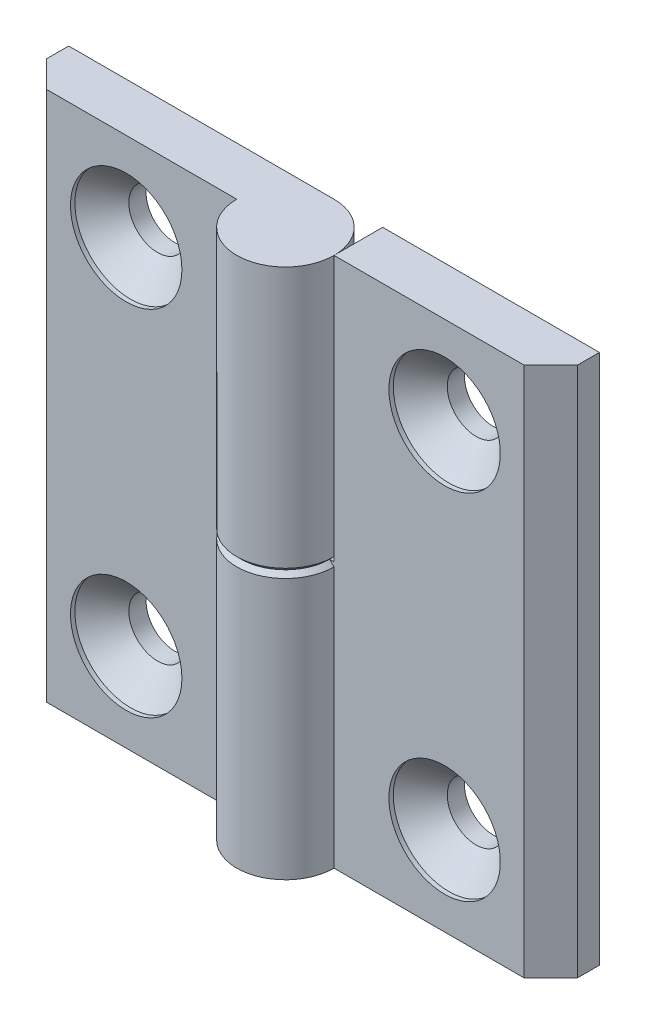
ISO-10303-21;
HEADER;
FILE_DESCRIPTION(('STEP AP214'),'2;1');
FILE_NAME('part.step','',(''),(''),'','','');
FILE_SCHEMA(('AUTOMOTIVE_DESIGN { 1 0 10303 214 1 1 1 1 }'));
ENDSEC;
DATA;
#1=APPLICATION_CONTEXT('core data for automotive mechanical design processes');
#2=APPLICATION_PROTOCOL_DEFINITION('international standard','automotive_design',2000,#1);
#3=PRODUCT_CONTEXT('',#1,'mechanical');
#4=PRODUCT('Part','Part','',(#3));
#5=PRODUCT_RELATED_PRODUCT_CATEGORY('part','',(#4));
#6=PRODUCT_DEFINITION_FORMATION('','',#4);
#7=PRODUCT_DEFINITION_CONTEXT('part definition',#1,'design');
#8=PRODUCT_DEFINITION('design','',#6,#7);
#9=PRODUCT_DEFINITION_SHAPE('','',#8);
#10=(LENGTH_UNIT() NAMED_UNIT(*) SI_UNIT(.MILLI.,.METRE.));
#11=(NAMED_UNIT(*) PLANE_ANGLE_UNIT() SI_UNIT($,.RADIAN.));
#12=(NAMED_UNIT(*) SI_UNIT($,.STERADIAN.) SOLID_ANGLE_UNIT());
#13=UNCERTAINTY_MEASURE_WITH_UNIT(LENGTH_MEASURE(1.E-05),#10,'distance_accuracy_value','');
#14=(GEOMETRIC_REPRESENTATION_CONTEXT(3) GLOBAL_UNCERTAINTY_ASSIGNED_CONTEXT((#13)) GLOBAL_UNIT_ASSIGNED_CONTEXT((#10,
#11,#12)) REPRESENTATION_CONTEXT('',''));
#15=CARTESIAN_POINT('',(0.,0.,0.));
#16=DIRECTION('',(0.,0.,1.));
#17=DIRECTION('',(1.,0.,0.));
#18=AXIS2_PLACEMENT_3D('',#15,#16,#17);
#19=CARTESIAN_POINT('',(0.,-30.,0.));
#20=DIRECTION('',(0.,1.,0.));
#21=DIRECTION('',(0.,0.,-1.));
#22=AXIS2_PLACEMENT_3D('',#19,#20,#21);
#23=CYLINDRICAL_SURFACE('',#22,5.5);
#24=DIRECTION('',(0.,1.,0.));
#25=VECTOR('',#24,1.);
#26=CARTESIAN_POINT('',(5.5,-30.,0.));
#27=LINE('',#26,#25);
#28=CARTESIAN_POINT('',(5.5,-30.,0.));
#29=VERTEX_POINT('',#28);
#30=CARTESIAN_POINT('',(5.5,-0.49999999999999,0.));
#31=VERTEX_POINT('',#30);
#32=EDGE_CURVE('E157',#29,#31,#27,.T.);
#33=ORIENTED_EDGE('',*,*,#32,.T.);
#34=CARTESIAN_POINT('',(0.,-0.49999999999999,0.));
#35=DIRECTION('',(0.,-1.,0.));
#36=DIRECTION('',(0.,0.,1.));
#37=AXIS2_PLACEMENT_3D('',#34,#35,#36);
#38=CIRCLE('',#37,5.5);
#39=CARTESIAN_POINT('',(0.,-0.49999999999999,-5.5));
#40=VERTEX_POINT('',#39);
#41=EDGE_CURVE('E175',#31,#40,#38,.T.);
#42=ORIENTED_EDGE('',*,*,#41,.T.);
#43=DIRECTION('',(0.,1.,0.));
#44=VECTOR('',#43,1.);
#45=CARTESIAN_POINT('',(0.,-30.,-5.5));
#46=LINE('',#45,#44);
#47=CARTESIAN_POINT('',(0.,-30.,-5.5));
#48=VERTEX_POINT('',#47);
#49=EDGE_CURVE('E167',#48,#40,#46,.T.);
#50=ORIENTED_EDGE('',*,*,#49,.F.);
#51=CARTESIAN_POINT('',(0.,-30.,0.));
#52=DIRECTION('',(0.,-1.,0.));
#53=DIRECTION('',(0.,0.,1.));
#54=AXIS2_PLACEMENT_3D('',#51,#52,#53);
#55=CIRCLE('',#54,5.5);
#56=EDGE_CURVE('E156',#29,#48,#55,.T.);
#57=ORIENTED_EDGE('',*,*,#56,.F.);
#58=EDGE_LOOP('',(#33,#42,#50,#57));
#59=FACE_BOUND('',#58,.T.);
#60=ADVANCED_FACE('F46',(#59),#23,.T.);
#61=CARTESIAN_POINT('',(0.,-30.,-5.5));
#62=DIRECTION('',(0.,0.,1.));
#63=DIRECTION('',(-1.,0.,0.));
#64=AXIS2_PLACEMENT_3D('',#61,#62,#63);
#65=PLANE('',#64);
#66=CARTESIAN_POINT('',(18.,-20.,-5.50000000000013));
#67=DIRECTION('',(0.,0.,1.));
#68=DIRECTION('',(-1.,0.,0.));
#69=AXIS2_PLACEMENT_3D('',#66,#67,#68);
#70=CIRCLE('',#69,3.25);
#71=CARTESIAN_POINT('',(14.75,-20.,-5.50000000000011));
#72=VERTEX_POINT('',#71);
#73=EDGE_CURVE('E197',#72,#72,#70,.T.);
#74=ORIENTED_EDGE('',*,*,#73,.T.);
#75=EDGE_LOOP('',(#74));
#76=FACE_BOUND('',#75,.T.);
#77=CARTESIAN_POINT('',(18.,20.,-5.50000000000013));
#78=DIRECTION('',(0.,0.,1.));
#79=DIRECTION('',(-1.,0.,0.));
#80=AXIS2_PLACEMENT_3D('',#77,#78,#79);
#81=CIRCLE('',#80,3.25);
#82=CARTESIAN_POINT('',(14.75,20.,-5.50000000000011));
#83=VERTEX_POINT('',#82);
#84=EDGE_CURVE('E139',#83,#83,#81,.T.);
#85=ORIENTED_EDGE('',*,*,#84,.T.);
#86=EDGE_LOOP('',(#85));
#87=FACE_BOUND('',#86,.T.);
#88=ORIENTED_EDGE('',*,*,#49,.T.);
#89=DIRECTION('',(1.,0.,0.));
#90=VECTOR('',#89,1.);
#91=CARTESIAN_POINT('',(0.,-0.49999999999999,-5.5));
#92=LINE('',#91,#90);
#93=CARTESIAN_POINT('',(5.49999999999996,-0.49999999999999,-5.50000000000004));
#94=VERTEX_POINT('',#93);
#95=EDGE_CURVE('E138',#40,#94,#92,.T.);
#96=ORIENTED_EDGE('',*,*,#95,.T.);
#97=DIRECTION('',(0.,1.,0.));
#98=VECTOR('',#97,1.);
#99=CARTESIAN_POINT('',(5.49999999999996,30.,-5.50000000000004));
#100=LINE('',#99,#98);
#101=CARTESIAN_POINT('',(5.49999999999996,30.,-5.50000000000004));
#102=VERTEX_POINT('',#101);
#103=EDGE_CURVE('E119',#94,#102,#100,.T.);
#104=ORIENTED_EDGE('',*,*,#103,.T.);
#105=DIRECTION('',(1.,0.,0.));
#106=VECTOR('',#105,1.);
#107=CARTESIAN_POINT('',(0.,30.,-5.5));
#108=LINE('',#107,#106);
#109=CARTESIAN_POINT('',(30.,30.,-5.50000000000022));
#110=VERTEX_POINT('',#109);
#111=EDGE_CURVE('E135',#102,#110,#108,.T.);
#112=ORIENTED_EDGE('',*,*,#111,.T.);
#113=DIRECTION('',(0.,1.,0.));
#114=VECTOR('',#113,1.);
#115=CARTESIAN_POINT('',(30.,-30.,-5.50000000000022));
#116=LINE('',#115,#114);
#117=CARTESIAN_POINT('',(30.,-30.,-5.50000000000022));
#118=VERTEX_POINT('',#117);
#119=EDGE_CURVE('E165',#118,#110,#116,.T.);
#120=ORIENTED_EDGE('',*,*,#119,.F.);
#121=DIRECTION('',(1.,0.,0.));
#122=VECTOR('',#121,1.);
#123=CARTESIAN_POINT('',(0.,-30.,-5.5));
#124=LINE('',#123,#122);
#125=EDGE_CURVE('E213',#48,#118,#124,.T.);
#126=ORIENTED_EDGE('',*,*,#125,.F.);
#127=EDGE_LOOP('',(#88,#96,#104,#112,#120,#126));
#128=FACE_BOUND('',#127,.T.);
#129=ADVANCED_FACE('F133',(#76,#87,#128),#65,.F.);
#130=CARTESIAN_POINT('',(30.,-30.,-5.50000000000022));
#131=DIRECTION('',(-1.,0.,0.));
#132=DIRECTION('',(0.,0.,-1.));
#133=AXIS2_PLACEMENT_3D('',#130,#131,#132);
#134=PLANE('',#133);
#135=DIRECTION('',(0.,0.,1.));
#136=VECTOR('',#135,1.);
#137=CARTESIAN_POINT('',(30.,30.,-5.50000000000022));
#138=LINE('',#137,#136);
#139=CARTESIAN_POINT('',(30.,30.,-3.00000000000022));
#140=VERTEX_POINT('',#139);
#141=EDGE_CURVE('E144',#110,#140,#138,.T.);
#142=ORIENTED_EDGE('',*,*,#141,.T.);
#143=DIRECTION('',(0.,1.,0.));
#144=VECTOR('',#143,1.);
#145=CARTESIAN_POINT('',(30.,-30.,-3.00000000000022));
#146=LINE('',#145,#144);
#147=CARTESIAN_POINT('',(30.,-30.,-3.00000000000022));
#148=VERTEX_POINT('',#147);
#149=EDGE_CURVE('E162',#148,#140,#146,.T.);
#150=ORIENTED_EDGE('',*,*,#149,.F.);
#151=DIRECTION('',(0.,0.,1.));
#152=VECTOR('',#151,1.);
#153=CARTESIAN_POINT('',(30.,-30.,-5.50000000000022));
#154=LINE('',#153,#152);
#155=EDGE_CURVE('E215',#118,#148,#154,.T.);
#156=ORIENTED_EDGE('',*,*,#155,.F.);
#157=ORIENTED_EDGE('',*,*,#119,.T.);
#158=EDGE_LOOP('',(#142,#150,#156,#157));
#159=FACE_BOUND('',#158,.T.);
#160=ADVANCED_FACE('F229',(#159),#134,.F.);
#161=CARTESIAN_POINT('',(30.,-30.,-3.00000000000022));
#162=DIRECTION('',(-0.707106781186549,0.,-0.707106781186546));
#163=DIRECTION('',(0.707106781186546,0.,-0.707106781186549));
#164=AXIS2_PLACEMENT_3D('',#161,#162,#163);
#165=PLANE('',#164);
#166=DIRECTION('',(-0.707106781186546,0.,0.707106781186549));
#167=VECTOR('',#166,1.);
#168=CARTESIAN_POINT('',(30.,30.,-3.00000000000022));
#169=LINE('',#168,#167);
#170=CARTESIAN_POINT('',(27.,30.,-2.0176617772832E-13));
#171=VERTEX_POINT('',#170);
#172=EDGE_CURVE('E146',#140,#171,#169,.T.);
#173=ORIENTED_EDGE('',*,*,#172,.T.);
#174=DIRECTION('',(0.,1.,0.));
#175=VECTOR('',#174,1.);
#176=CARTESIAN_POINT('',(27.,-30.,-2.0176617772832E-13));
#177=LINE('',#176,#175);
#178=CARTESIAN_POINT('',(27.,-30.,-2.0176617772832E-13));
#179=VERTEX_POINT('',#178);
#180=EDGE_CURVE('E159',#179,#171,#177,.T.);
#181=ORIENTED_EDGE('',*,*,#180,.F.);
#182=DIRECTION('',(-0.707106781186546,0.,0.707106781186549));
#183=VECTOR('',#182,1.);
#184=CARTESIAN_POINT('',(30.,-30.,-3.00000000000022));
#185=LINE('',#184,#183);
#186=EDGE_CURVE('E216',#148,#179,#185,.T.);
#187=ORIENTED_EDGE('',*,*,#186,.F.);
#188=ORIENTED_EDGE('',*,*,#149,.T.);
#189=EDGE_LOOP('',(#173,#181,#187,#188));
#190=FACE_BOUND('',#189,.T.);
#191=ADVANCED_FACE('F231',(#190),#165,.F.);
#192=CARTESIAN_POINT('',(27.,-30.,-2.0176617772832E-13));
#193=DIRECTION('',(0.,0.,-1.));
#194=DIRECTION('',(1.,0.,0.));
#195=AXIS2_PLACEMENT_3D('',#192,#193,#194);
#196=PLANE('',#195);
#197=CARTESIAN_POINT('',(18.,-20.,-1.34727625586711E-13));
#198=DIRECTION('',(0.,0.,1.));
#199=DIRECTION('',(-1.,0.,0.));
#200=AXIS2_PLACEMENT_3D('',#197,#198,#199);
#201=CIRCLE('',#200,6.3);
#202=CARTESIAN_POINT('',(11.7,-20.,0.));
#203=VERTEX_POINT('',#202);
#204=EDGE_CURVE('E185',#203,#203,#201,.T.);
#205=ORIENTED_EDGE('',*,*,#204,.F.);
#206=EDGE_LOOP('',(#205));
#207=FACE_BOUND('',#206,.T.);
#208=CARTESIAN_POINT('',(18.,20.,-1.34727625586711E-13));
#209=DIRECTION('',(0.,0.,1.));
#210=DIRECTION('',(-1.,0.,0.));
#211=AXIS2_PLACEMENT_3D('',#208,#209,#210);
#212=CIRCLE('',#211,6.3);
#213=CARTESIAN_POINT('',(11.7,20.,0.));
#214=VERTEX_POINT('',#213);
#215=EDGE_CURVE('E200',#214,#214,#212,.T.);
#216=ORIENTED_EDGE('',*,*,#215,.F.);
#217=EDGE_LOOP('',(#216));
#218=FACE_BOUND('',#217,.T.);
#219=DIRECTION('',(-1.,0.,0.));
#220=VECTOR('',#219,1.);
#221=CARTESIAN_POINT('',(27.,30.,-2.0176617772832E-13));
#222=LINE('',#221,#220);
#223=CARTESIAN_POINT('',(5.5,30.,0.));
#224=VERTEX_POINT('',#223);
#225=EDGE_CURVE('E154',#171,#224,#222,.T.);
#226=ORIENTED_EDGE('',*,*,#225,.T.);
#227=DIRECTION('',(0.,-1.,0.));
#228=VECTOR('',#227,1.);
#229=CARTESIAN_POINT('',(5.5,-30.,0.));
#230=LINE('',#229,#228);
#231=CARTESIAN_POINT('',(5.5,0.,0.));
#232=VERTEX_POINT('',#231);
#233=EDGE_CURVE('E123',#224,#232,#230,.T.);
#234=ORIENTED_EDGE('',*,*,#233,.T.);
#235=DIRECTION('',(1.,0.,0.));
#236=VECTOR('',#235,1.);
#237=CARTESIAN_POINT('',(-5.5,0.,0.));
#238=LINE('',#237,#236);
#239=CARTESIAN_POINT('',(5.00000000000001,0.,0.));
#240=VERTEX_POINT('',#239);
#241=EDGE_CURVE('E170',#240,#232,#238,.T.);
#242=ORIENTED_EDGE('',*,*,#241,.F.);
#243=DIRECTION('',(0.707106781186546,-0.707106781186549,0.));
#244=VECTOR('',#243,1.);
#245=CARTESIAN_POINT('',(0.,5.00000000000004,0.));
#246=LINE('',#245,#244);
#247=EDGE_CURVE('E12',#240,#31,#246,.T.);
#248=ORIENTED_EDGE('',*,*,#247,.T.);
#249=ORIENTED_EDGE('',*,*,#32,.F.);
#250=DIRECTION('',(-1.,0.,0.));
#251=VECTOR('',#250,1.);
#252=CARTESIAN_POINT('',(27.,-30.,-2.0176617772832E-13));
#253=LINE('',#252,#251);
#254=EDGE_CURVE('E150',#179,#29,#253,.T.);
#255=ORIENTED_EDGE('',*,*,#254,.F.);
#256=ORIENTED_EDGE('',*,*,#180,.T.);
#257=EDGE_LOOP('',(#226,#234,#242,#248,#249,#255,#256));
#258=FACE_BOUND('',#257,.T.);
#259=ADVANCED_FACE('F224',(#207,#218,#258),#196,.F.);
#260=CARTESIAN_POINT('',(0.,-30.,0.));
#261=DIRECTION('',(0.,-1.,0.));
#262=DIRECTION('',(0.,0.,1.));
#263=AXIS2_PLACEMENT_3D('',#260,#261,#262);
#264=PLANE('',#263);
#265=ORIENTED_EDGE('',*,*,#56,.T.);
#266=ORIENTED_EDGE('',*,*,#125,.T.);
#267=ORIENTED_EDGE('',*,*,#155,.T.);
#268=ORIENTED_EDGE('',*,*,#186,.T.);
#269=ORIENTED_EDGE('',*,*,#254,.T.);
#270=EDGE_LOOP('',(#265,#266,#267,#268,#269));
#271=FACE_BOUND('',#270,.T.);
#272=ADVANCED_FACE('F221',(#271),#264,.T.);
#273=CARTESIAN_POINT('',(0.,30.,0.));
#274=DIRECTION('',(0.,-1.,0.));
#275=DIRECTION('',(0.,0.,1.));
#276=AXIS2_PLACEMENT_3D('',#273,#274,#275);
#277=PLANE('',#276);
#278=ORIENTED_EDGE('',*,*,#111,.F.);
#279=DIRECTION('',(0.,0.,1.));
#280=VECTOR('',#279,1.);
#281=CARTESIAN_POINT('',(5.49999999999996,30.,-5.50000000000004));
#282=LINE('',#281,#280);
#283=EDGE_CURVE('E116',#102,#224,#282,.T.);
#284=ORIENTED_EDGE('',*,*,#283,.T.);
#285=ORIENTED_EDGE('',*,*,#225,.F.);
#286=ORIENTED_EDGE('',*,*,#172,.F.);
#287=ORIENTED_EDGE('',*,*,#141,.F.);
#288=EDGE_LOOP('',(#278,#284,#285,#286,#287));
#289=FACE_BOUND('',#288,.T.);
#290=ADVANCED_FACE('F142',(#289),#277,.F.);
#291=CARTESIAN_POINT('',(-5.50000000000004,0.,-5.49999999999996));
#292=DIRECTION('',(0.,-1.,0.));
#293=DIRECTION('',(0.,0.,1.));
#294=AXIS2_PLACEMENT_3D('',#291,#292,#293);
#295=PLANE('',#294);
#296=DIRECTION('',(0.,0.,1.));
#297=VECTOR('',#296,1.);
#298=CARTESIAN_POINT('',(5.49999999999996,0.,-5.50000000000004));
#299=LINE('',#298,#297);
#300=CARTESIAN_POINT('',(5.49999999999996,0.,-5.00000000000005));
#301=VERTEX_POINT('',#300);
#302=EDGE_CURVE('E128',#301,#232,#299,.T.);
#303=ORIENTED_EDGE('',*,*,#302,.F.);
#304=DIRECTION('',(-1.,0.,0.));
#305=VECTOR('',#304,1.);
#306=CARTESIAN_POINT('',(-5.50000000000004,0.,-4.99999999999997));
#307=LINE('',#306,#305);
#308=CARTESIAN_POINT('',(0.,0.,-5.00000000000001));
#309=VERTEX_POINT('',#308);
#310=EDGE_CURVE('E69',#301,#309,#307,.T.);
#311=ORIENTED_EDGE('',*,*,#310,.T.);
#312=CARTESIAN_POINT('',(0.,0.,0.));
#313=DIRECTION('',(0.,-1.,0.));
#314=DIRECTION('',(0.,0.,1.));
#315=AXIS2_PLACEMENT_3D('',#312,#313,#314);
#316=CIRCLE('',#315,5.00000000000001);
#317=EDGE_CURVE('E172',#309,#240,#316,.F.);
#318=ORIENTED_EDGE('',*,*,#317,.T.);
#319=ORIENTED_EDGE('',*,*,#241,.T.);
#320=EDGE_LOOP('',(#303,#311,#318,#319));
#321=FACE_BOUND('',#320,.T.);
#322=ADVANCED_FACE('F178',(#321),#295,.F.);
#323=CARTESIAN_POINT('',(5.49999999999996,30.,-5.50000000000004));
#324=DIRECTION('',(1.,0.,0.));
#325=DIRECTION('',(0.,0.,1.));
#326=AXIS2_PLACEMENT_3D('',#323,#324,#325);
#327=PLANE('',#326);
#328=ORIENTED_EDGE('',*,*,#283,.F.);
#329=ORIENTED_EDGE('',*,*,#103,.F.);
#330=DIRECTION('',(0.,-0.70710678118655,-0.707106781186546));
#331=VECTOR('',#330,1.);
#332=CARTESIAN_POINT('',(5.50000000000007,14.7500000000001,9.74999999999996));
#333=LINE('',#332,#331);
#334=EDGE_CURVE('E56',#94,#301,#333,.F.);
#335=ORIENTED_EDGE('',*,*,#334,.T.);
#336=ORIENTED_EDGE('',*,*,#302,.T.);
#337=ORIENTED_EDGE('',*,*,#233,.F.);
#338=EDGE_LOOP('',(#328,#329,#335,#336,#337));
#339=FACE_BOUND('',#338,.T.);
#340=ADVANCED_FACE('F118',(#339),#327,.F.);
#341=CARTESIAN_POINT('',(18.,20.,-1.34510785152214E-13));
#342=DIRECTION('',(0.,0.,1.));
#343=DIRECTION('',(-1.,0.,0.));
#344=AXIS2_PLACEMENT_3D('',#341,#342,#343);
#345=CYLINDRICAL_SURFACE('',#344,3.25);
#346=ORIENTED_EDGE('',*,*,#84,.F.);
#347=EDGE_LOOP('',(#346));
#348=FACE_BOUND('',#347,.T.);
#349=CARTESIAN_POINT('',(18.,20.,-3.55000000000013));
#350=DIRECTION('',(0.,0.,1.));
#351=DIRECTION('',(-1.,0.,0.));
#352=AXIS2_PLACEMENT_3D('',#349,#350,#351);
#353=CIRCLE('',#352,3.25);
#354=CARTESIAN_POINT('',(14.75,20.,-3.55000000000011));
#355=VERTEX_POINT('',#354);
#356=EDGE_CURVE('E206',#355,#355,#353,.T.);
#357=ORIENTED_EDGE('',*,*,#356,.T.);
#358=EDGE_LOOP('',(#357));
#359=FACE_BOUND('',#358,.T.);
#360=ADVANCED_FACE('F269',(#348,#359),#345,.F.);
#361=CARTESIAN_POINT('',(18.,20.,-0.500000000000135));
#362=DIRECTION('',(0.,0.,1.));
#363=DIRECTION('',(-1.,0.,0.));
#364=AXIS2_PLACEMENT_3D('',#361,#362,#363);
#365=CONICAL_SURFACE('',#364,6.3,0.785398163397449);
#366=ORIENTED_EDGE('',*,*,#356,.F.);
#367=EDGE_LOOP('',(#366));
#368=FACE_BOUND('',#367,.T.);
#369=CARTESIAN_POINT('',(18.,20.,-0.500000000000135));
#370=DIRECTION('',(0.,0.,1.));
#371=DIRECTION('',(-1.,0.,0.));
#372=AXIS2_PLACEMENT_3D('',#369,#370,#371);
#373=CIRCLE('',#372,6.3);
#374=CARTESIAN_POINT('',(11.7,20.,-0.500000000000088));
#375=VERTEX_POINT('',#374);
#376=EDGE_CURVE('E203',#375,#375,#373,.T.);
#377=ORIENTED_EDGE('',*,*,#376,.T.);
#378=EDGE_LOOP('',(#377));
#379=FACE_BOUND('',#378,.T.);
#380=ADVANCED_FACE('F272',(#368,#379),#365,.F.);
#381=CARTESIAN_POINT('',(18.,20.,-1.34510785152214E-13));
#382=DIRECTION('',(0.,0.,1.));
#383=DIRECTION('',(-1.,0.,0.));
#384=AXIS2_PLACEMENT_3D('',#381,#382,#383);
#385=CYLINDRICAL_SURFACE('',#384,6.3);
#386=ORIENTED_EDGE('',*,*,#376,.F.);
#387=EDGE_LOOP('',(#386));
#388=FACE_BOUND('',#387,.T.);
#389=ORIENTED_EDGE('',*,*,#215,.T.);
#390=EDGE_LOOP('',(#389));
#391=FACE_BOUND('',#390,.T.);
#392=ADVANCED_FACE('F276',(#388,#391),#385,.F.);
#393=CARTESIAN_POINT('',(18.,-20.,-1.34510785152214E-13));
#394=DIRECTION('',(0.,0.,1.));
#395=DIRECTION('',(-1.,0.,0.));
#396=AXIS2_PLACEMENT_3D('',#393,#394,#395);
#397=CYLINDRICAL_SURFACE('',#396,3.25);
#398=ORIENTED_EDGE('',*,*,#73,.F.);
#399=EDGE_LOOP('',(#398));
#400=FACE_BOUND('',#399,.T.);
#401=CARTESIAN_POINT('',(18.,-20.,-3.55000000000013));
#402=DIRECTION('',(0.,0.,1.));
#403=DIRECTION('',(-1.,0.,0.));
#404=AXIS2_PLACEMENT_3D('',#401,#402,#403);
#405=CIRCLE('',#404,3.25);
#406=CARTESIAN_POINT('',(14.75,-20.,-3.55000000000011));
#407=VERTEX_POINT('',#406);
#408=EDGE_CURVE('E192',#407,#407,#405,.T.);
#409=ORIENTED_EDGE('',*,*,#408,.T.);
#410=EDGE_LOOP('',(#409));
#411=FACE_BOUND('',#410,.T.);
#412=ADVANCED_FACE('F280',(#400,#411),#397,.F.);
#413=CARTESIAN_POINT('',(18.,-20.,-0.500000000000135));
#414=DIRECTION('',(0.,0.,1.));
#415=DIRECTION('',(-1.,0.,0.));
#416=AXIS2_PLACEMENT_3D('',#413,#414,#415);
#417=CONICAL_SURFACE('',#416,6.3,0.785398163397449);
#418=ORIENTED_EDGE('',*,*,#408,.F.);
#419=EDGE_LOOP('',(#418));
#420=FACE_BOUND('',#419,.T.);
#421=CARTESIAN_POINT('',(18.,-20.,-0.500000000000135));
#422=DIRECTION('',(0.,0.,1.));
#423=DIRECTION('',(-1.,0.,0.));
#424=AXIS2_PLACEMENT_3D('',#421,#422,#423);
#425=CIRCLE('',#424,6.3);
#426=CARTESIAN_POINT('',(11.7,-20.,-0.500000000000088));
#427=VERTEX_POINT('',#426);
#428=EDGE_CURVE('E187',#427,#427,#425,.T.);
#429=ORIENTED_EDGE('',*,*,#428,.T.);
#430=EDGE_LOOP('',(#429));
#431=FACE_BOUND('',#430,.T.);
#432=ADVANCED_FACE('F238',(#420,#431),#417,.F.);
#433=CARTESIAN_POINT('',(18.,-20.,-1.34510785152214E-13));
#434=DIRECTION('',(0.,0.,1.));
#435=DIRECTION('',(-1.,0.,0.));
#436=AXIS2_PLACEMENT_3D('',#433,#434,#435);
#437=CYLINDRICAL_SURFACE('',#436,6.3);
#438=ORIENTED_EDGE('',*,*,#428,.F.);
#439=EDGE_LOOP('',(#438));
#440=FACE_BOUND('',#439,.T.);
#441=ORIENTED_EDGE('',*,*,#204,.T.);
#442=EDGE_LOOP('',(#441));
#443=FACE_BOUND('',#442,.T.);
#444=ADVANCED_FACE('F233',(#440,#443),#437,.F.);
#445=CARTESIAN_POINT('',(0.,-0.49999999999999,0.));
#446=DIRECTION('',(0.,-1.,0.));
#447=DIRECTION('',(0.,0.,1.));
#448=AXIS2_PLACEMENT_3D('',#445,#446,#447);
#449=CONICAL_SURFACE('',#448,5.5,0.785398163397446);
#450=ORIENTED_EDGE('',*,*,#247,.F.);
#451=ORIENTED_EDGE('',*,*,#317,.F.);
#452=DIRECTION('',(0.,0.707106781186549,0.707106781186546));
#453=VECTOR('',#452,1.);
#454=CARTESIAN_POINT('',(0.,-0.49999999999999,-5.5));
#455=LINE('',#454,#453);
#456=EDGE_CURVE('E51',#40,#309,#455,.T.);
#457=ORIENTED_EDGE('',*,*,#456,.F.);
#458=ORIENTED_EDGE('',*,*,#41,.F.);
#459=EDGE_LOOP('',(#450,#451,#457,#458));
#460=FACE_BOUND('',#459,.T.);
#461=ADVANCED_FACE('F49',(#460),#449,.T.);
#462=CARTESIAN_POINT('',(0.,-0.49999999999999,-5.5));
#463=DIRECTION('',(0.,-0.707106781186546,0.70710678118655));
#464=DIRECTION('',(1.,0.,0.));
#465=AXIS2_PLACEMENT_3D('',#462,#463,#464);
#466=PLANE('',#465);
#467=ORIENTED_EDGE('',*,*,#456,.T.);
#468=ORIENTED_EDGE('',*,*,#310,.F.);
#469=ORIENTED_EDGE('',*,*,#334,.F.);
#470=ORIENTED_EDGE('',*,*,#95,.F.);
#471=EDGE_LOOP('',(#467,#468,#469,#470));
#472=FACE_BOUND('',#471,.T.);
#473=ADVANCED_FACE('F181',(#472),#466,.F.);
#474=CLOSED_SHELL('',(#60,#129,#160,#191,#259,#272,#290,#322,#340,#360,#380,#392,#412,#432,#444,
#461,#473));
#475=MANIFOLD_SOLID_BREP('B2',#474);
#476=CARTESIAN_POINT('',(0.,30.,0.));
#477=DIRECTION('',(0.,-1.,0.));
#478=DIRECTION('',(0.,0.,-1.));
#479=AXIS2_PLACEMENT_3D('',#476,#477,#478);
#480=CYLINDRICAL_SURFACE('',#479,5.5);
#481=DIRECTION('',(0.,-1.,0.));
#482=VECTOR('',#481,1.);
#483=CARTESIAN_POINT('',(-5.5,30.,0.));
#484=LINE('',#483,#482);
#485=CARTESIAN_POINT('',(-5.5,30.,0.));
#486=VERTEX_POINT('',#485);
#487=CARTESIAN_POINT('',(-5.5,0.49999999999999,0.));
#488=VERTEX_POINT('',#487);
#489=EDGE_CURVE('E512',#486,#488,#484,.T.);
#490=ORIENTED_EDGE('',*,*,#489,.T.);
#491=CARTESIAN_POINT('',(0.,0.49999999999999,0.));
#492=DIRECTION('',(0.,1.,0.));
#493=DIRECTION('',(0.,0.,1.));
#494=AXIS2_PLACEMENT_3D('',#491,#492,#493);
#495=CIRCLE('',#494,5.5);
#496=CARTESIAN_POINT('',(0.,0.49999999999999,-5.5));
#497=VERTEX_POINT('',#496);
#498=EDGE_CURVE('E530',#488,#497,#495,.T.);
#499=ORIENTED_EDGE('',*,*,#498,.T.);
#500=DIRECTION('',(0.,-1.,0.));
#501=VECTOR('',#500,1.);
#502=CARTESIAN_POINT('',(0.,30.,-5.5));
#503=LINE('',#502,#501);
#504=CARTESIAN_POINT('',(0.,30.,-5.5));
#505=VERTEX_POINT('',#504);
#506=EDGE_CURVE('E522',#505,#497,#503,.T.);
#507=ORIENTED_EDGE('',*,*,#506,.F.);
#508=CARTESIAN_POINT('',(0.,30.,0.));
#509=DIRECTION('',(0.,1.,0.));
#510=DIRECTION('',(0.,0.,1.));
#511=AXIS2_PLACEMENT_3D('',#508,#509,#510);
#512=CIRCLE('',#511,5.5);
#513=EDGE_CURVE('E511',#486,#505,#512,.T.);
#514=ORIENTED_EDGE('',*,*,#513,.F.);
#515=EDGE_LOOP('',(#490,#499,#507,#514));
#516=FACE_BOUND('',#515,.T.);
#517=ADVANCED_FACE('F401',(#516),#480,.T.);
#518=CARTESIAN_POINT('',(0.,30.,-5.5));
#519=DIRECTION('',(0.,0.,1.));
#520=DIRECTION('',(1.,0.,0.));
#521=AXIS2_PLACEMENT_3D('',#518,#519,#520);
#522=PLANE('',#521);
#523=CARTESIAN_POINT('',(-18.,20.,-5.5));
#524=DIRECTION('',(0.,0.,1.));
#525=DIRECTION('',(1.,0.,0.));
#526=AXIS2_PLACEMENT_3D('',#523,#524,#525);
#527=CIRCLE('',#526,3.25);
#528=CARTESIAN_POINT('',(-14.75,20.,-5.5));
#529=VERTEX_POINT('',#528);
#530=EDGE_CURVE('E552',#529,#529,#527,.T.);
#531=ORIENTED_EDGE('',*,*,#530,.T.);
#532=EDGE_LOOP('',(#531));
#533=FACE_BOUND('',#532,.T.);
#534=CARTESIAN_POINT('',(-18.,-20.,-5.5));
#535=DIRECTION('',(0.,0.,1.));
#536=DIRECTION('',(1.,0.,0.));
#537=AXIS2_PLACEMENT_3D('',#534,#535,#536);
#538=CIRCLE('',#537,3.25);
#539=CARTESIAN_POINT('',(-14.75,-20.,-5.5));
#540=VERTEX_POINT('',#539);
#541=EDGE_CURVE('E494',#540,#540,#538,.T.);
#542=ORIENTED_EDGE('',*,*,#541,.T.);
#543=EDGE_LOOP('',(#542));
#544=FACE_BOUND('',#543,.T.);
#545=ORIENTED_EDGE('',*,*,#506,.T.);
#546=DIRECTION('',(-1.,0.,0.));
#547=VECTOR('',#546,1.);
#548=CARTESIAN_POINT('',(0.,0.49999999999999,-5.5));
#549=LINE('',#548,#547);
#550=CARTESIAN_POINT('',(-5.5,0.49999999999999,-5.5));
#551=VERTEX_POINT('',#550);
#552=EDGE_CURVE('E493',#497,#551,#549,.T.);
#553=ORIENTED_EDGE('',*,*,#552,.T.);
#554=DIRECTION('',(0.,-1.,0.));
#555=VECTOR('',#554,1.);
#556=CARTESIAN_POINT('',(-5.5,-30.,-5.5));
#557=LINE('',#556,#555);
#558=CARTESIAN_POINT('',(-5.5,-30.,-5.5));
#559=VERTEX_POINT('',#558);
#560=EDGE_CURVE('E474',#551,#559,#557,.T.);
#561=ORIENTED_EDGE('',*,*,#560,.T.);
#562=DIRECTION('',(-1.,0.,0.));
#563=VECTOR('',#562,1.);
#564=CARTESIAN_POINT('',(0.,-30.,-5.5));
#565=LINE('',#564,#563);
#566=CARTESIAN_POINT('',(-30.,-30.,-5.5));
#567=VERTEX_POINT('',#566);
#568=EDGE_CURVE('E490',#559,#567,#565,.T.);
#569=ORIENTED_EDGE('',*,*,#568,.T.);
#570=DIRECTION('',(0.,-1.,0.));
#571=VECTOR('',#570,1.);
#572=CARTESIAN_POINT('',(-30.,30.,-5.5));
#573=LINE('',#572,#571);
#574=CARTESIAN_POINT('',(-30.,30.,-5.5));
#575=VERTEX_POINT('',#574);
#576=EDGE_CURVE('E520',#575,#567,#573,.T.);
#577=ORIENTED_EDGE('',*,*,#576,.F.);
#578=DIRECTION('',(-1.,0.,0.));
#579=VECTOR('',#578,1.);
#580=CARTESIAN_POINT('',(0.,30.,-5.5));
#581=LINE('',#580,#579);
#582=EDGE_CURVE('E568',#505,#575,#581,.T.);
#583=ORIENTED_EDGE('',*,*,#582,.F.);
#584=EDGE_LOOP('',(#545,#553,#561,#569,#577,#583));
#585=FACE_BOUND('',#584,.T.);
#586=ADVANCED_FACE('F488',(#533,#544,#585),#522,.F.);
#587=CARTESIAN_POINT('',(-30.,30.,-5.5));
#588=DIRECTION('',(1.,0.,0.));
#589=DIRECTION('',(0.,0.,-1.));
#590=AXIS2_PLACEMENT_3D('',#587,#588,#589);
#591=PLANE('',#590);
#592=DIRECTION('',(0.,0.,1.));
#593=VECTOR('',#592,1.);
#594=CARTESIAN_POINT('',(-30.,-30.,-5.5));
#595=LINE('',#594,#593);
#596=CARTESIAN_POINT('',(-30.,-30.,-3.));
#597=VERTEX_POINT('',#596);
#598=EDGE_CURVE('E499',#567,#597,#595,.T.);
#599=ORIENTED_EDGE('',*,*,#598,.T.);
#600=DIRECTION('',(0.,-1.,0.));
#601=VECTOR('',#600,1.);
#602=CARTESIAN_POINT('',(-30.,30.,-3.));
#603=LINE('',#602,#601);
#604=CARTESIAN_POINT('',(-30.,30.,-3.));
#605=VERTEX_POINT('',#604);
#606=EDGE_CURVE('E517',#605,#597,#603,.T.);
#607=ORIENTED_EDGE('',*,*,#606,.F.);
#608=DIRECTION('',(0.,0.,1.));
#609=VECTOR('',#608,1.);
#610=CARTESIAN_POINT('',(-30.,30.,-5.5));
#611=LINE('',#610,#609);
#612=EDGE_CURVE('E570',#575,#605,#611,.T.);
#613=ORIENTED_EDGE('',*,*,#612,.F.);
#614=ORIENTED_EDGE('',*,*,#576,.T.);
#615=EDGE_LOOP('',(#599,#607,#613,#614));
#616=FACE_BOUND('',#615,.T.);
#617=ADVANCED_FACE('F584',(#616),#591,.F.);
#618=CARTESIAN_POINT('',(-30.,30.,-3.));
#619=DIRECTION('',(0.707106781186543,0.,-0.707106781186552));
#620=DIRECTION('',(-0.707106781186552,0.,-0.707106781186543));
#621=AXIS2_PLACEMENT_3D('',#618,#619,#620);
#622=PLANE('',#621);
#623=DIRECTION('',(0.707106781186552,0.,0.707106781186543));
#624=VECTOR('',#623,1.);
#625=CARTESIAN_POINT('',(-30.,-30.,-3.));
#626=LINE('',#625,#624);
#627=CARTESIAN_POINT('',(-27.,-30.,0.));
#628=VERTEX_POINT('',#627);
#629=EDGE_CURVE('E501',#597,#628,#626,.T.);
#630=ORIENTED_EDGE('',*,*,#629,.T.);
#631=DIRECTION('',(0.,-1.,0.));
#632=VECTOR('',#631,1.);
#633=CARTESIAN_POINT('',(-27.,30.,0.));
#634=LINE('',#633,#632);
#635=CARTESIAN_POINT('',(-27.,30.,0.));
#636=VERTEX_POINT('',#635);
#637=EDGE_CURVE('E514',#636,#628,#634,.T.);
#638=ORIENTED_EDGE('',*,*,#637,.F.);
#639=DIRECTION('',(0.707106781186552,0.,0.707106781186543));
#640=VECTOR('',#639,1.);
#641=CARTESIAN_POINT('',(-30.,30.,-3.));
#642=LINE('',#641,#640);
#643=EDGE_CURVE('E571',#605,#636,#642,.T.);
#644=ORIENTED_EDGE('',*,*,#643,.F.);
#645=ORIENTED_EDGE('',*,*,#606,.T.);
#646=EDGE_LOOP('',(#630,#638,#644,#645));
#647=FACE_BOUND('',#646,.T.);
#648=ADVANCED_FACE('F586',(#647),#622,.F.);
#649=CARTESIAN_POINT('',(-27.,30.,0.));
#650=DIRECTION('',(0.,0.,-1.));
#651=DIRECTION('',(-1.,0.,0.));
#652=AXIS2_PLACEMENT_3D('',#649,#650,#651);
#653=PLANE('',#652);
#654=CARTESIAN_POINT('',(-18.,20.,0.));
#655=DIRECTION('',(0.,0.,1.));
#656=DIRECTION('',(1.,0.,0.));
#657=AXIS2_PLACEMENT_3D('',#654,#655,#656);
#658=CIRCLE('',#657,6.3);
#659=CARTESIAN_POINT('',(-11.7,20.,0.));
#660=VERTEX_POINT('',#659);
#661=EDGE_CURVE('E540',#660,#660,#658,.T.);
#662=ORIENTED_EDGE('',*,*,#661,.F.);
#663=EDGE_LOOP('',(#662));
#664=FACE_BOUND('',#663,.T.);
#665=CARTESIAN_POINT('',(-18.,-20.,0.));
#666=DIRECTION('',(0.,0.,1.));
#667=DIRECTION('',(1.,0.,0.));
#668=AXIS2_PLACEMENT_3D('',#665,#666,#667);
#669=CIRCLE('',#668,6.3);
#670=CARTESIAN_POINT('',(-11.7,-20.,0.));
#671=VERTEX_POINT('',#670);
#672=EDGE_CURVE('E555',#671,#671,#669,.T.);
#673=ORIENTED_EDGE('',*,*,#672,.F.);
#674=EDGE_LOOP('',(#673));
#675=FACE_BOUND('',#674,.T.);
#676=DIRECTION('',(1.,0.,0.));
#677=VECTOR('',#676,1.);
#678=CARTESIAN_POINT('',(-27.,-30.,0.));
#679=LINE('',#678,#677);
#680=CARTESIAN_POINT('',(-5.5,-30.,0.));
#681=VERTEX_POINT('',#680);
#682=EDGE_CURVE('E509',#628,#681,#679,.T.);
#683=ORIENTED_EDGE('',*,*,#682,.T.);
#684=DIRECTION('',(0.,1.,0.));
#685=VECTOR('',#684,1.);
#686=CARTESIAN_POINT('',(-5.5,30.,0.));
#687=LINE('',#686,#685);
#688=CARTESIAN_POINT('',(-5.5,0.,0.));
#689=VERTEX_POINT('',#688);
#690=EDGE_CURVE('E478',#681,#689,#687,.T.);
#691=ORIENTED_EDGE('',*,*,#690,.T.);
#692=DIRECTION('',(-1.,0.,0.));
#693=VECTOR('',#692,1.);
#694=CARTESIAN_POINT('',(5.5,0.,0.));
#695=LINE('',#694,#693);
#696=CARTESIAN_POINT('',(-5.00000000000001,0.,0.));
#697=VERTEX_POINT('',#696);
#698=EDGE_CURVE('E525',#697,#689,#695,.T.);
#699=ORIENTED_EDGE('',*,*,#698,.F.);
#700=DIRECTION('',(-0.707106781186546,0.707106781186549,0.));
#701=VECTOR('',#700,1.);
#702=CARTESIAN_POINT('',(0.,-5.00000000000004,0.));
#703=LINE('',#702,#701);
#704=EDGE_CURVE('E44',#697,#488,#703,.T.);
#705=ORIENTED_EDGE('',*,*,#704,.T.);
#706=ORIENTED_EDGE('',*,*,#489,.F.);
#707=DIRECTION('',(1.,0.,0.));
#708=VECTOR('',#707,1.);
#709=CARTESIAN_POINT('',(-27.,30.,0.));
#710=LINE('',#709,#708);
#711=EDGE_CURVE('E505',#636,#486,#710,.T.);
#712=ORIENTED_EDGE('',*,*,#711,.F.);
#713=ORIENTED_EDGE('',*,*,#637,.T.);
#714=EDGE_LOOP('',(#683,#691,#699,#705,#706,#712,#713));
#715=FACE_BOUND('',#714,.T.);
#716=ADVANCED_FACE('F579',(#664,#675,#715),#653,.F.);
#717=CARTESIAN_POINT('',(0.,30.,0.));
#718=DIRECTION('',(0.,1.,0.));
#719=DIRECTION('',(0.,0.,1.));
#720=AXIS2_PLACEMENT_3D('',#717,#718,#719);
#721=PLANE('',#720);
#722=ORIENTED_EDGE('',*,*,#513,.T.);
#723=ORIENTED_EDGE('',*,*,#582,.T.);
#724=ORIENTED_EDGE('',*,*,#612,.T.);
#725=ORIENTED_EDGE('',*,*,#643,.T.);
#726=ORIENTED_EDGE('',*,*,#711,.T.);
#727=EDGE_LOOP('',(#722,#723,#724,#725,#726));
#728=FACE_BOUND('',#727,.T.);
#729=ADVANCED_FACE('F576',(#728),#721,.T.);
#730=CARTESIAN_POINT('',(0.,-30.,0.));
#731=DIRECTION('',(0.,1.,0.));
#732=DIRECTION('',(0.,0.,1.));
#733=AXIS2_PLACEMENT_3D('',#730,#731,#732);
#734=PLANE('',#733);
#735=ORIENTED_EDGE('',*,*,#568,.F.);
#736=DIRECTION('',(0.,0.,1.));
#737=VECTOR('',#736,1.);
#738=CARTESIAN_POINT('',(-5.5,-30.,-5.5));
#739=LINE('',#738,#737);
#740=EDGE_CURVE('E471',#559,#681,#739,.T.);
#741=ORIENTED_EDGE('',*,*,#740,.T.);
#742=ORIENTED_EDGE('',*,*,#682,.F.);
#743=ORIENTED_EDGE('',*,*,#629,.F.);
#744=ORIENTED_EDGE('',*,*,#598,.F.);
#745=EDGE_LOOP('',(#735,#741,#742,#743,#744));
#746=FACE_BOUND('',#745,.T.);
#747=ADVANCED_FACE('F497',(#746),#734,.F.);
#748=CARTESIAN_POINT('',(5.5,0.,-5.5));
#749=DIRECTION('',(0.,1.,0.));
#750=DIRECTION('',(0.,0.,1.));
#751=AXIS2_PLACEMENT_3D('',#748,#749,#750);
#752=PLANE('',#751);
#753=DIRECTION('',(0.,0.,1.));
#754=VECTOR('',#753,1.);
#755=CARTESIAN_POINT('',(-5.5,0.,-5.5));
#756=LINE('',#755,#754);
#757=CARTESIAN_POINT('',(-5.5,0.,-5.00000000000001));
#758=VERTEX_POINT('',#757);
#759=EDGE_CURVE('E483',#758,#689,#756,.T.);
#760=ORIENTED_EDGE('',*,*,#759,.F.);
#761=DIRECTION('',(1.,0.,0.));
#762=VECTOR('',#761,1.);
#763=CARTESIAN_POINT('',(5.5,0.,-5.00000000000001));
#764=LINE('',#763,#762);
#765=CARTESIAN_POINT('',(0.,0.,-5.00000000000001));
#766=VERTEX_POINT('',#765);
#767=EDGE_CURVE('E424',#758,#766,#764,.T.);
#768=ORIENTED_EDGE('',*,*,#767,.T.);
#769=CARTESIAN_POINT('',(0.,0.,0.));
#770=DIRECTION('',(0.,1.,0.));
#771=DIRECTION('',(0.,0.,1.));
#772=AXIS2_PLACEMENT_3D('',#769,#770,#771);
#773=CIRCLE('',#772,5.00000000000001);
#774=EDGE_CURVE('E527',#766,#697,#773,.F.);
#775=ORIENTED_EDGE('',*,*,#774,.T.);
#776=ORIENTED_EDGE('',*,*,#698,.T.);
#777=EDGE_LOOP('',(#760,#768,#775,#776));
#778=FACE_BOUND('',#777,.T.);
#779=ADVANCED_FACE('F533',(#778),#752,.F.);
#780=CARTESIAN_POINT('',(-5.5,-30.,-5.5));
#781=DIRECTION('',(-1.,0.,0.));
#782=DIRECTION('',(0.,0.,1.));
#783=AXIS2_PLACEMENT_3D('',#780,#781,#782);
#784=PLANE('',#783);
#785=ORIENTED_EDGE('',*,*,#740,.F.);
#786=ORIENTED_EDGE('',*,*,#560,.F.);
#787=DIRECTION('',(0.,0.70710678118655,-0.707106781186546));
#788=VECTOR('',#787,1.);
#789=CARTESIAN_POINT('',(-5.5,-14.7500000000001,9.75));
#790=LINE('',#789,#788);
#791=EDGE_CURVE('E411',#551,#758,#790,.F.);
#792=ORIENTED_EDGE('',*,*,#791,.T.);
#793=ORIENTED_EDGE('',*,*,#759,.T.);
#794=ORIENTED_EDGE('',*,*,#690,.F.);
#795=EDGE_LOOP('',(#785,#786,#792,#793,#794));
#796=FACE_BOUND('',#795,.T.);
#797=ADVANCED_FACE('F473',(#796),#784,.F.);
#798=CARTESIAN_POINT('',(-18.,-20.,0.));
#799=DIRECTION('',(0.,0.,1.));
#800=DIRECTION('',(1.,0.,0.));
#801=AXIS2_PLACEMENT_3D('',#798,#799,#800);
#802=CYLINDRICAL_SURFACE('',#801,3.25);
#803=ORIENTED_EDGE('',*,*,#541,.F.);
#804=EDGE_LOOP('',(#803));
#805=FACE_BOUND('',#804,.T.);
#806=CARTESIAN_POINT('',(-18.,-20.,-3.55));
#807=DIRECTION('',(0.,0.,1.));
#808=DIRECTION('',(1.,0.,0.));
#809=AXIS2_PLACEMENT_3D('',#806,#807,#808);
#810=CIRCLE('',#809,3.25);
#811=CARTESIAN_POINT('',(-14.75,-20.,-3.55));
#812=VERTEX_POINT('',#811);
#813=EDGE_CURVE('E561',#812,#812,#810,.T.);
#814=ORIENTED_EDGE('',*,*,#813,.T.);
#815=EDGE_LOOP('',(#814));
#816=FACE_BOUND('',#815,.T.);
#817=ADVANCED_FACE('F624',(#805,#816),#802,.F.);
#818=CARTESIAN_POINT('',(-18.,-20.,-0.5));
#819=DIRECTION('',(0.,0.,1.));
#820=DIRECTION('',(1.,0.,0.));
#821=AXIS2_PLACEMENT_3D('',#818,#819,#820);
#822=CONICAL_SURFACE('',#821,6.3,0.785398163397449);
#823=ORIENTED_EDGE('',*,*,#813,.F.);
#824=EDGE_LOOP('',(#823));
#825=FACE_BOUND('',#824,.T.);
#826=CARTESIAN_POINT('',(-18.,-20.,-0.5));
#827=DIRECTION('',(0.,0.,1.));
#828=DIRECTION('',(1.,0.,0.));
#829=AXIS2_PLACEMENT_3D('',#826,#827,#828);
#830=CIRCLE('',#829,6.3);
#831=CARTESIAN_POINT('',(-11.7,-20.,-0.5));
#832=VERTEX_POINT('',#831);
#833=EDGE_CURVE('E558',#832,#832,#830,.T.);
#834=ORIENTED_EDGE('',*,*,#833,.T.);
#835=EDGE_LOOP('',(#834));
#836=FACE_BOUND('',#835,.T.);
#837=ADVANCED_FACE('F627',(#825,#836),#822,.F.);
#838=CARTESIAN_POINT('',(-18.,-20.,0.));
#839=DIRECTION('',(0.,0.,1.));
#840=DIRECTION('',(1.,0.,0.));
#841=AXIS2_PLACEMENT_3D('',#838,#839,#840);
#842=CYLINDRICAL_SURFACE('',#841,6.3);
#843=ORIENTED_EDGE('',*,*,#833,.F.);
#844=EDGE_LOOP('',(#843));
#845=FACE_BOUND('',#844,.T.);
#846=ORIENTED_EDGE('',*,*,#672,.T.);
#847=EDGE_LOOP('',(#846));
#848=FACE_BOUND('',#847,.T.);
#849=ADVANCED_FACE('F631',(#845,#848),#842,.F.);
#850=CARTESIAN_POINT('',(-18.,20.,0.));
#851=DIRECTION('',(0.,0.,1.));
#852=DIRECTION('',(1.,0.,0.));
#853=AXIS2_PLACEMENT_3D('',#850,#851,#852);
#854=CYLINDRICAL_SURFACE('',#853,3.25);
#855=ORIENTED_EDGE('',*,*,#530,.F.);
#856=EDGE_LOOP('',(#855));
#857=FACE_BOUND('',#856,.T.);
#858=CARTESIAN_POINT('',(-18.,20.,-3.55));
#859=DIRECTION('',(0.,0.,1.));
#860=DIRECTION('',(1.,0.,0.));
#861=AXIS2_PLACEMENT_3D('',#858,#859,#860);
#862=CIRCLE('',#861,3.25);
#863=CARTESIAN_POINT('',(-14.75,20.,-3.55));
#864=VERTEX_POINT('',#863);
#865=EDGE_CURVE('E547',#864,#864,#862,.T.);
#866=ORIENTED_EDGE('',*,*,#865,.T.);
#867=EDGE_LOOP('',(#866));
#868=FACE_BOUND('',#867,.T.);
#869=ADVANCED_FACE('F635',(#857,#868),#854,.F.);
#870=CARTESIAN_POINT('',(-18.,20.,-0.5));
#871=DIRECTION('',(0.,0.,1.));
#872=DIRECTION('',(1.,0.,0.));
#873=AXIS2_PLACEMENT_3D('',#870,#871,#872);
#874=CONICAL_SURFACE('',#873,6.3,0.785398163397449);
#875=ORIENTED_EDGE('',*,*,#865,.F.);
#876=EDGE_LOOP('',(#875));
#877=FACE_BOUND('',#876,.T.);
#878=CARTESIAN_POINT('',(-18.,20.,-0.5));
#879=DIRECTION('',(0.,0.,1.));
#880=DIRECTION('',(1.,0.,0.));
#881=AXIS2_PLACEMENT_3D('',#878,#879,#880);
#882=CIRCLE('',#881,6.3);
#883=CARTESIAN_POINT('',(-11.7,20.,-0.5));
#884=VERTEX_POINT('',#883);
#885=EDGE_CURVE('E542',#884,#884,#882,.T.);
#886=ORIENTED_EDGE('',*,*,#885,.T.);
#887=EDGE_LOOP('',(#886));
#888=FACE_BOUND('',#887,.T.);
#889=ADVANCED_FACE('F593',(#877,#888),#874,.F.);
#890=CARTESIAN_POINT('',(-18.,20.,0.));
#891=DIRECTION('',(0.,0.,1.));
#892=DIRECTION('',(1.,0.,0.));
#893=AXIS2_PLACEMENT_3D('',#890,#891,#892);
#894=CYLINDRICAL_SURFACE('',#893,6.3);
#895=ORIENTED_EDGE('',*,*,#885,.F.);
#896=EDGE_LOOP('',(#895));
#897=FACE_BOUND('',#896,.T.);
#898=ORIENTED_EDGE('',*,*,#661,.T.);
#899=EDGE_LOOP('',(#898));
#900=FACE_BOUND('',#899,.T.);
#901=ADVANCED_FACE('F588',(#897,#900),#894,.F.);
#902=CARTESIAN_POINT('',(0.,0.49999999999999,0.));
#903=DIRECTION('',(0.,1.,0.));
#904=DIRECTION('',(0.,0.,1.));
#905=AXIS2_PLACEMENT_3D('',#902,#903,#904);
#906=CONICAL_SURFACE('',#905,5.5,0.785398163397446);
#907=ORIENTED_EDGE('',*,*,#704,.F.);
#908=ORIENTED_EDGE('',*,*,#774,.F.);
#909=DIRECTION('',(0.,-0.707106781186549,0.707106781186546));
#910=VECTOR('',#909,1.);
#911=CARTESIAN_POINT('',(0.,0.49999999999999,-5.5));
#912=LINE('',#911,#910);
#913=EDGE_CURVE('E406',#497,#766,#912,.T.);
#914=ORIENTED_EDGE('',*,*,#913,.F.);
#915=ORIENTED_EDGE('',*,*,#498,.F.);
#916=EDGE_LOOP('',(#907,#908,#914,#915));
#917=FACE_BOUND('',#916,.T.);
#918=ADVANCED_FACE('F404',(#917),#906,.T.);
#919=CARTESIAN_POINT('',(0.,0.49999999999999,-5.5));
#920=DIRECTION('',(0.,0.707106781186546,0.70710678118655));
#921=DIRECTION('',(-1.,0.,0.));
#922=AXIS2_PLACEMENT_3D('',#919,#920,#921);
#923=PLANE('',#922);
#924=ORIENTED_EDGE('',*,*,#913,.T.);
#925=ORIENTED_EDGE('',*,*,#767,.F.);
#926=ORIENTED_EDGE('',*,*,#791,.F.);
#927=ORIENTED_EDGE('',*,*,#552,.F.);
#928=EDGE_LOOP('',(#924,#925,#926,#927));
#929=FACE_BOUND('',#928,.T.);
#930=ADVANCED_FACE('F536',(#929),#923,.F.);
#931=CLOSED_SHELL('',(#517,#586,#617,#648,#716,#729,#747,#779,#797,#817,#837,#849,#869,#889,
#901,#918,#930));
#932=MANIFOLD_SOLID_BREP('B6',#931);
#933=ADVANCED_BREP_SHAPE_REPRESENTATION('',(#18,#475,#932),#14);
#934=SHAPE_DEFINITION_REPRESENTATION(#9,#933);
ENDSEC;
END-ISO-10303-21;
